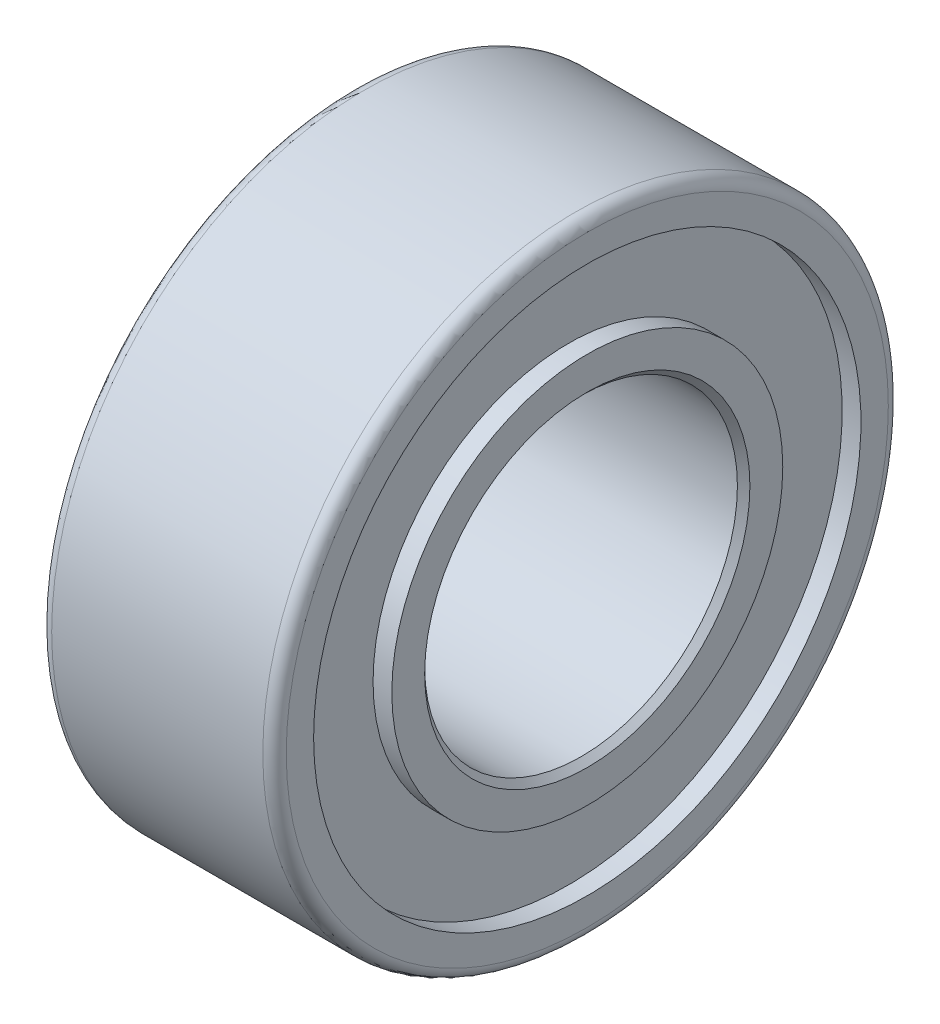
ISO-10303-21;
HEADER;
FILE_DESCRIPTION(('STEP AP214'),'2;1');
FILE_NAME('part.step','',(''),(''),'','','');
FILE_SCHEMA(('AUTOMOTIVE_DESIGN { 1 0 10303 214 1 1 1 1 }'));
ENDSEC;
DATA;
#1=APPLICATION_CONTEXT('core data for automotive mechanical design processes');
#2=APPLICATION_PROTOCOL_DEFINITION('international standard','automotive_design',2000,#1);
#3=PRODUCT_CONTEXT('',#1,'mechanical');
#4=PRODUCT('Part','Part','',(#3));
#5=PRODUCT_RELATED_PRODUCT_CATEGORY('part','',(#4));
#6=PRODUCT_DEFINITION_FORMATION('','',#4);
#7=PRODUCT_DEFINITION_CONTEXT('part definition',#1,'design');
#8=PRODUCT_DEFINITION('design','',#6,#7);
#9=PRODUCT_DEFINITION_SHAPE('','',#8);
#10=(LENGTH_UNIT() NAMED_UNIT(*) SI_UNIT(.MILLI.,.METRE.));
#11=(NAMED_UNIT(*) PLANE_ANGLE_UNIT() SI_UNIT($,.RADIAN.));
#12=(NAMED_UNIT(*) SI_UNIT($,.STERADIAN.) SOLID_ANGLE_UNIT());
#13=UNCERTAINTY_MEASURE_WITH_UNIT(LENGTH_MEASURE(1.E-05),#10,'distance_accuracy_value','');
#14=(GEOMETRIC_REPRESENTATION_CONTEXT(3) GLOBAL_UNCERTAINTY_ASSIGNED_CONTEXT((#13)) GLOBAL_UNIT_ASSIGNED_CONTEXT((#10,
#11,#12)) REPRESENTATION_CONTEXT('',''));
#15=CARTESIAN_POINT('',(0.,0.,0.));
#16=DIRECTION('',(0.,0.,1.));
#17=DIRECTION('',(1.,0.,0.));
#18=AXIS2_PLACEMENT_3D('',#15,#16,#17);
#19=CARTESIAN_POINT('',(0.,0.,0.));
#20=DIRECTION('',(-1.,0.,0.));
#21=DIRECTION('',(0.,0.,1.));
#22=AXIS2_PLACEMENT_3D('',#19,#20,#21);
#23=CYLINDRICAL_SURFACE('',#22,3.175);
#24=CARTESIAN_POINT('',(-2.25424999996449,0.,0.));
#25=DIRECTION('',(-1.,0.,0.));
#26=DIRECTION('',(0.,0.,1.));
#27=AXIS2_PLACEMENT_3D('',#24,#25,#26);
#28=CIRCLE('',#27,3.17499999999882);
#29=CARTESIAN_POINT('',(-2.25424999996449,0.,3.17499999999882));
#30=VERTEX_POINT('',#29);
#31=EDGE_CURVE('E65',#30,#30,#28,.T.);
#32=ORIENTED_EDGE('',*,*,#31,.T.);
#33=EDGE_LOOP('',(#32));
#34=FACE_BOUND('',#33,.T.);
#35=CARTESIAN_POINT('',(2.25425000002133,0.,0.));
#36=DIRECTION('',(1.,0.,0.));
#37=DIRECTION('',(0.,0.,-1.));
#38=AXIS2_PLACEMENT_3D('',#35,#36,#37);
#39=CIRCLE('',#38,3.17500000005566);
#40=CARTESIAN_POINT('',(2.25425000002133,0.,-3.17500000005566));
#41=VERTEX_POINT('',#40);
#42=EDGE_CURVE('E292',#41,#41,#39,.T.);
#43=ORIENTED_EDGE('',*,*,#42,.T.);
#44=EDGE_LOOP('',(#43));
#45=FACE_BOUND('',#44,.T.);
#46=ADVANCED_FACE('F17',(#34,#45),#23,.F.);
#47=CARTESIAN_POINT('',(2.38125000004175,0.,0.));
#48=DIRECTION('',(1.,0.,0.));
#49=DIRECTION('',(0.,0.,-1.));
#50=AXIS2_PLACEMENT_3D('',#47,#48,#49);
#51=CONICAL_SURFACE('',#50,3.30200000001923,0.785398163173655);
#52=CARTESIAN_POINT('',(2.38125000004175,0.,0.));
#53=DIRECTION('',(1.,0.,0.));
#54=DIRECTION('',(0.,0.,-1.));
#55=AXIS2_PLACEMENT_3D('',#52,#53,#54);
#56=CIRCLE('',#55,3.30200000001923);
#57=CARTESIAN_POINT('',(2.38125000004175,0.,-3.30200000001923));
#58=VERTEX_POINT('',#57);
#59=EDGE_CURVE('E314',#58,#58,#56,.T.);
#60=ORIENTED_EDGE('',*,*,#59,.T.);
#61=EDGE_LOOP('',(#60));
#62=FACE_BOUND('',#61,.T.);
#63=ORIENTED_EDGE('',*,*,#42,.F.);
#64=EDGE_LOOP('',(#63));
#65=FACE_BOUND('',#64,.T.);
#66=ADVANCED_FACE('F161',(#62,#65),#51,.F.);
#67=CARTESIAN_POINT('',(-2.38124999992806,0.,0.));
#68=DIRECTION('',(-1.,0.,0.));
#69=DIRECTION('',(0.,0.,1.));
#70=AXIS2_PLACEMENT_3D('',#67,#68,#69);
#71=CONICAL_SURFACE('',#70,3.30199999990555,0.785398163397448);
#72=CARTESIAN_POINT('',(-2.3812499999849,0.,0.));
#73=DIRECTION('',(-1.,0.,0.));
#74=DIRECTION('',(0.,0.,1.));
#75=AXIS2_PLACEMENT_3D('',#72,#73,#74);
#76=CIRCLE('',#75,3.30199999996239);
#77=CARTESIAN_POINT('',(-2.3812499999849,0.,3.30199999996239));
#78=VERTEX_POINT('',#77);
#79=EDGE_CURVE('E311',#78,#78,#76,.T.);
#80=ORIENTED_EDGE('',*,*,#79,.T.);
#81=EDGE_LOOP('',(#80));
#82=FACE_BOUND('',#81,.T.);
#83=ORIENTED_EDGE('',*,*,#31,.F.);
#84=EDGE_LOOP('',(#83));
#85=FACE_BOUND('',#84,.T.);
#86=ADVANCED_FACE('F158',(#82,#85),#71,.F.);
#87=CARTESIAN_POINT('',(2.38125,3.175,0.));
#88=DIRECTION('',(-1.,0.,0.));
#89=DIRECTION('',(0.,0.,1.));
#90=AXIS2_PLACEMENT_3D('',#87,#88,#89);
#91=PLANE('',#90);
#92=CARTESIAN_POINT('',(2.38125,0.,0.));
#93=DIRECTION('',(-1.,0.,0.));
#94=DIRECTION('',(0.,0.,1.));
#95=AXIS2_PLACEMENT_3D('',#92,#93,#94);
#96=CIRCLE('',#95,3.96875);
#97=CARTESIAN_POINT('',(2.38125,0.,3.96875));
#98=VERTEX_POINT('',#97);
#99=EDGE_CURVE('E308',#98,#98,#96,.T.);
#100=ORIENTED_EDGE('',*,*,#99,.F.);
#101=EDGE_LOOP('',(#100));
#102=FACE_BOUND('',#101,.T.);
#103=ORIENTED_EDGE('',*,*,#59,.F.);
#104=EDGE_LOOP('',(#103));
#105=FACE_BOUND('',#104,.T.);
#106=ADVANCED_FACE('F154',(#102,#105),#91,.F.);
#107=CARTESIAN_POINT('',(-2.38125,3.96875,0.));
#108=DIRECTION('',(1.,0.,0.));
#109=DIRECTION('',(0.,0.,-1.));
#110=AXIS2_PLACEMENT_3D('',#107,#108,#109);
#111=PLANE('',#110);
#112=CARTESIAN_POINT('',(-2.38125,0.,0.));
#113=DIRECTION('',(-1.,0.,0.));
#114=DIRECTION('',(0.,0.,1.));
#115=AXIS2_PLACEMENT_3D('',#112,#113,#114);
#116=CIRCLE('',#115,3.96875);
#117=CARTESIAN_POINT('',(-2.38125,0.,3.96875));
#118=VERTEX_POINT('',#117);
#119=EDGE_CURVE('E305',#118,#118,#116,.F.);
#120=ORIENTED_EDGE('',*,*,#119,.F.);
#121=EDGE_LOOP('',(#120));
#122=FACE_BOUND('',#121,.T.);
#123=ORIENTED_EDGE('',*,*,#79,.F.);
#124=EDGE_LOOP('',(#123));
#125=FACE_BOUND('',#124,.T.);
#126=ADVANCED_FACE('F150',(#122,#125),#111,.F.);
#127=CARTESIAN_POINT('',(0.,0.,0.));
#128=DIRECTION('',(-1.,0.,0.));
#129=DIRECTION('',(0.,0.,1.));
#130=AXIS2_PLACEMENT_3D('',#127,#128,#129);
#131=CYLINDRICAL_SURFACE('',#130,3.96875);
#132=CARTESIAN_POINT('',(2.00025,0.,0.));
#133=DIRECTION('',(-1.,0.,0.));
#134=DIRECTION('',(0.,0.,1.));
#135=AXIS2_PLACEMENT_3D('',#132,#133,#134);
#136=CIRCLE('',#135,3.96875);
#137=CARTESIAN_POINT('',(2.00025,0.,3.96875));
#138=VERTEX_POINT('',#137);
#139=EDGE_CURVE('E302',#138,#138,#136,.F.);
#140=ORIENTED_EDGE('',*,*,#139,.T.);
#141=EDGE_LOOP('',(#140));
#142=FACE_BOUND('',#141,.T.);
#143=ORIENTED_EDGE('',*,*,#99,.T.);
#144=EDGE_LOOP('',(#143));
#145=FACE_BOUND('',#144,.T.);
#146=ADVANCED_FACE('F146',(#142,#145),#131,.T.);
#147=CARTESIAN_POINT('',(0.,0.,0.));
#148=DIRECTION('',(-1.,0.,0.));
#149=DIRECTION('',(0.,0.,1.));
#150=AXIS2_PLACEMENT_3D('',#147,#148,#149);
#151=CYLINDRICAL_SURFACE('',#150,3.96875);
#152=ORIENTED_EDGE('',*,*,#119,.T.);
#153=EDGE_LOOP('',(#152));
#154=FACE_BOUND('',#153,.T.);
#155=CARTESIAN_POINT('',(-2.00025,0.,0.));
#156=DIRECTION('',(-1.,0.,0.));
#157=DIRECTION('',(0.,0.,1.));
#158=AXIS2_PLACEMENT_3D('',#155,#156,#157);
#159=CIRCLE('',#158,3.96875);
#160=CARTESIAN_POINT('',(-2.00025,0.,3.96875));
#161=VERTEX_POINT('',#160);
#162=EDGE_CURVE('E299',#161,#161,#159,.T.);
#163=ORIENTED_EDGE('',*,*,#162,.T.);
#164=EDGE_LOOP('',(#163));
#165=FACE_BOUND('',#164,.T.);
#166=ADVANCED_FACE('F142',(#154,#165),#151,.T.);
#167=CARTESIAN_POINT('',(2.00025,3.96875,0.));
#168=DIRECTION('',(-1.,0.,0.));
#169=DIRECTION('',(0.,0.,1.));
#170=AXIS2_PLACEMENT_3D('',#167,#168,#169);
#171=PLANE('',#170);
#172=ORIENTED_EDGE('',*,*,#139,.F.);
#173=EDGE_LOOP('',(#172));
#174=FACE_BOUND('',#173,.T.);
#175=CARTESIAN_POINT('',(2.00025,0.,0.));
#176=DIRECTION('',(-1.,0.,0.));
#177=DIRECTION('',(0.,0.,1.));
#178=AXIS2_PLACEMENT_3D('',#175,#176,#177);
#179=CIRCLE('',#178,5.55625);
#180=CARTESIAN_POINT('',(2.00025,0.,5.55625));
#181=VERTEX_POINT('',#180);
#182=EDGE_CURVE('E296',#181,#181,#179,.F.);
#183=ORIENTED_EDGE('',*,*,#182,.T.);
#184=EDGE_LOOP('',(#183));
#185=FACE_BOUND('',#184,.T.);
#186=ADVANCED_FACE('F138',(#174,#185),#171,.F.);
#187=CARTESIAN_POINT('',(-2.00025,5.55625,0.));
#188=DIRECTION('',(1.,0.,0.));
#189=DIRECTION('',(0.,0.,-1.));
#190=AXIS2_PLACEMENT_3D('',#187,#188,#189);
#191=PLANE('',#190);
#192=CARTESIAN_POINT('',(-2.00025,0.,0.));
#193=DIRECTION('',(-1.,0.,0.));
#194=DIRECTION('',(0.,0.,1.));
#195=AXIS2_PLACEMENT_3D('',#192,#193,#194);
#196=CIRCLE('',#195,5.55625);
#197=CARTESIAN_POINT('',(-2.00025,0.,5.55625));
#198=VERTEX_POINT('',#197);
#199=EDGE_CURVE('E290',#198,#198,#196,.T.);
#200=ORIENTED_EDGE('',*,*,#199,.T.);
#201=EDGE_LOOP('',(#200));
#202=FACE_BOUND('',#201,.T.);
#203=ORIENTED_EDGE('',*,*,#162,.F.);
#204=EDGE_LOOP('',(#203));
#205=FACE_BOUND('',#204,.T.);
#206=ADVANCED_FACE('F134',(#202,#205),#191,.F.);
#207=CARTESIAN_POINT('',(0.,0.,0.));
#208=DIRECTION('',(-1.,0.,0.));
#209=DIRECTION('',(0.,0.,1.));
#210=AXIS2_PLACEMENT_3D('',#207,#208,#209);
#211=CYLINDRICAL_SURFACE('',#210,5.55625);
#212=CARTESIAN_POINT('',(2.38125,0.,0.));
#213=DIRECTION('',(-1.,0.,0.));
#214=DIRECTION('',(0.,0.,1.));
#215=AXIS2_PLACEMENT_3D('',#212,#213,#214);
#216=CIRCLE('',#215,5.55625);
#217=CARTESIAN_POINT('',(2.38125,0.,5.55625));
#218=VERTEX_POINT('',#217);
#219=EDGE_CURVE('E287',#218,#218,#216,.F.);
#220=ORIENTED_EDGE('',*,*,#219,.T.);
#221=EDGE_LOOP('',(#220));
#222=FACE_BOUND('',#221,.T.);
#223=ORIENTED_EDGE('',*,*,#182,.F.);
#224=EDGE_LOOP('',(#223));
#225=FACE_BOUND('',#224,.T.);
#226=ADVANCED_FACE('F130',(#222,#225),#211,.F.);
#227=CARTESIAN_POINT('',(0.,0.,0.));
#228=DIRECTION('',(-1.,0.,0.));
#229=DIRECTION('',(0.,0.,1.));
#230=AXIS2_PLACEMENT_3D('',#227,#228,#229);
#231=CYLINDRICAL_SURFACE('',#230,5.55625);
#232=ORIENTED_EDGE('',*,*,#199,.F.);
#233=EDGE_LOOP('',(#232));
#234=FACE_BOUND('',#233,.T.);
#235=CARTESIAN_POINT('',(-2.38125,0.,0.));
#236=DIRECTION('',(-1.,0.,0.));
#237=DIRECTION('',(0.,0.,1.));
#238=AXIS2_PLACEMENT_3D('',#235,#236,#237);
#239=CIRCLE('',#238,5.55625);
#240=CARTESIAN_POINT('',(-2.38125,0.,5.55625));
#241=VERTEX_POINT('',#240);
#242=EDGE_CURVE('E52',#241,#241,#239,.T.);
#243=ORIENTED_EDGE('',*,*,#242,.T.);
#244=EDGE_LOOP('',(#243));
#245=FACE_BOUND('',#244,.T.);
#246=ADVANCED_FACE('F125',(#234,#245),#231,.F.);
#247=CARTESIAN_POINT('',(2.38125,5.55625,0.));
#248=DIRECTION('',(-1.,0.,0.));
#249=DIRECTION('',(0.,0.,1.));
#250=AXIS2_PLACEMENT_3D('',#247,#248,#249);
#251=PLANE('',#250);
#252=ORIENTED_EDGE('',*,*,#219,.F.);
#253=EDGE_LOOP('',(#252));
#254=FACE_BOUND('',#253,.T.);
#255=CARTESIAN_POINT('',(2.38125,0.,0.));
#256=DIRECTION('',(-1.,0.,0.));
#257=DIRECTION('',(0.,0.,1.));
#258=AXIS2_PLACEMENT_3D('',#255,#256,#257);
#259=CIRCLE('',#258,6.111875);
#260=CARTESIAN_POINT('',(2.38125,0.,6.111875));
#261=VERTEX_POINT('',#260);
#262=CARTESIAN_POINT('',(2.38125,0.,-6.111875));
#263=VERTEX_POINT('',#262);
#264=EDGE_CURVE('E45',#261,#263,#259,.T.);
#265=ORIENTED_EDGE('',*,*,#264,.F.);
#266=CARTESIAN_POINT('',(2.38125,0.,0.));
#267=DIRECTION('',(-1.,0.,0.));
#268=DIRECTION('',(0.,0.,-1.));
#269=AXIS2_PLACEMENT_3D('',#266,#267,#268);
#270=CIRCLE('',#269,6.111875);
#271=EDGE_CURVE('E48',#263,#261,#270,.T.);
#272=ORIENTED_EDGE('',*,*,#271,.F.);
#273=EDGE_LOOP('',(#265,#272));
#274=FACE_BOUND('',#273,.T.);
#275=ADVANCED_FACE('F50',(#254,#274),#251,.F.);
#276=CARTESIAN_POINT('',(-2.38125,6.35,0.));
#277=DIRECTION('',(1.,0.,0.));
#278=DIRECTION('',(0.,0.,-1.));
#279=AXIS2_PLACEMENT_3D('',#276,#277,#278);
#280=PLANE('',#279);
#281=ORIENTED_EDGE('',*,*,#242,.F.);
#282=EDGE_LOOP('',(#281));
#283=FACE_BOUND('',#282,.T.);
#284=CARTESIAN_POINT('',(-2.38125,0.,0.));
#285=DIRECTION('',(1.,0.,0.));
#286=DIRECTION('',(0.,0.,-1.));
#287=AXIS2_PLACEMENT_3D('',#284,#285,#286);
#288=CIRCLE('',#287,6.111875);
#289=CARTESIAN_POINT('',(-2.38125,0.,-6.111875));
#290=VERTEX_POINT('',#289);
#291=CARTESIAN_POINT('',(-2.38125,0.,6.111875));
#292=VERTEX_POINT('',#291);
#293=EDGE_CURVE('E57',#290,#292,#288,.T.);
#294=ORIENTED_EDGE('',*,*,#293,.F.);
#295=CARTESIAN_POINT('',(-2.38125,0.,0.));
#296=DIRECTION('',(1.,0.,0.));
#297=DIRECTION('',(0.,0.,1.));
#298=AXIS2_PLACEMENT_3D('',#295,#296,#297);
#299=CIRCLE('',#298,6.111875);
#300=EDGE_CURVE('E36',#292,#290,#299,.T.);
#301=ORIENTED_EDGE('',*,*,#300,.F.);
#302=EDGE_LOOP('',(#294,#301));
#303=FACE_BOUND('',#302,.T.);
#304=ADVANCED_FACE('F78',(#283,#303),#280,.F.);
#305=CARTESIAN_POINT('',(2.143125,0.,0.));
#306=DIRECTION('',(-1.,0.,0.));
#307=DIRECTION('',(0.,0.,1.));
#308=AXIS2_PLACEMENT_3D('',#305,#306,#307);
#309=TOROIDAL_SURFACE('',#308,6.111875,0.238125);
#310=CARTESIAN_POINT('',(2.143125,0.,0.));
#311=DIRECTION('',(-1.,0.,0.));
#312=DIRECTION('',(0.,0.,1.));
#313=AXIS2_PLACEMENT_3D('',#310,#311,#312);
#314=CIRCLE('',#313,6.35);
#315=CARTESIAN_POINT('',(2.143125,0.,6.35));
#316=VERTEX_POINT('',#315);
#317=EDGE_CURVE('E28',#316,#316,#314,.T.);
#318=ORIENTED_EDGE('',*,*,#317,.F.);
#319=EDGE_LOOP('',(#318));
#320=FACE_BOUND('',#319,.T.);
#321=ORIENTED_EDGE('',*,*,#264,.T.);
#322=ORIENTED_EDGE('',*,*,#271,.T.);
#323=EDGE_LOOP('',(#321,#322));
#324=FACE_BOUND('',#323,.T.);
#325=ADVANCED_FACE('F56',(#320,#324),#309,.T.);
#326=CARTESIAN_POINT('',(-2.143125,0.,0.));
#327=DIRECTION('',(1.,0.,0.));
#328=DIRECTION('',(0.,0.,-1.));
#329=AXIS2_PLACEMENT_3D('',#326,#327,#328);
#330=TOROIDAL_SURFACE('',#329,6.111875,0.238125);
#331=CARTESIAN_POINT('',(-2.143125,0.,0.));
#332=DIRECTION('',(-1.,0.,0.));
#333=DIRECTION('',(0.,0.,1.));
#334=AXIS2_PLACEMENT_3D('',#331,#332,#333);
#335=CIRCLE('',#334,6.35);
#336=CARTESIAN_POINT('',(-2.143125,0.,6.35));
#337=VERTEX_POINT('',#336);
#338=EDGE_CURVE('E11',#337,#337,#335,.F.);
#339=ORIENTED_EDGE('',*,*,#338,.F.);
#340=EDGE_LOOP('',(#339));
#341=FACE_BOUND('',#340,.T.);
#342=ORIENTED_EDGE('',*,*,#293,.T.);
#343=ORIENTED_EDGE('',*,*,#300,.T.);
#344=EDGE_LOOP('',(#342,#343));
#345=FACE_BOUND('',#344,.T.);
#346=ADVANCED_FACE('F77',(#341,#345),#330,.T.);
#347=CARTESIAN_POINT('',(0.,0.,0.));
#348=DIRECTION('',(-1.,0.,0.));
#349=DIRECTION('',(0.,0.,1.));
#350=AXIS2_PLACEMENT_3D('',#347,#348,#349);
#351=CYLINDRICAL_SURFACE('',#350,6.35);
#352=ORIENTED_EDGE('',*,*,#338,.T.);
#353=EDGE_LOOP('',(#352));
#354=FACE_BOUND('',#353,.T.);
#355=ORIENTED_EDGE('',*,*,#317,.T.);
#356=EDGE_LOOP('',(#355));
#357=FACE_BOUND('',#356,.T.);
#358=ADVANCED_FACE('F172',(#354,#357),#351,.T.);
#359=CLOSED_SHELL('',(#46,#66,#86,#106,#126,#146,#166,#186,#206,#226,#246,#275,#304,#325,#346,#358));
#360=MANIFOLD_SOLID_BREP('B1',#359);
#361=ADVANCED_BREP_SHAPE_REPRESENTATION('',(#18,#360),#14);
#362=SHAPE_DEFINITION_REPRESENTATION(#9,#361);
ENDSEC;
END-ISO-10303-21;
